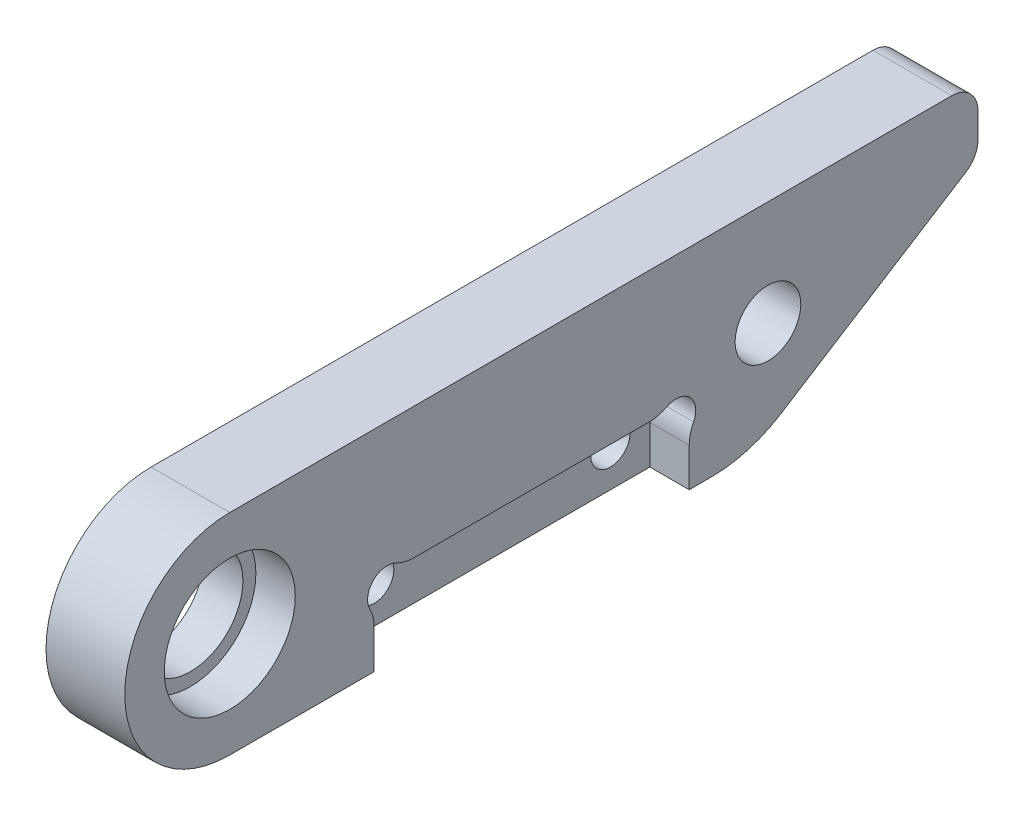
ISO-10303-21;
HEADER;
FILE_DESCRIPTION(('STEP AP214'),'2;1');
FILE_NAME('part.step','',(''),(''),'','','');
FILE_SCHEMA(('AUTOMOTIVE_DESIGN { 1 0 10303 214 1 1 1 1 }'));
ENDSEC;
DATA;
#1=APPLICATION_CONTEXT('core data for automotive mechanical design processes');
#2=APPLICATION_PROTOCOL_DEFINITION('international standard','automotive_design',2000,#1);
#3=PRODUCT_CONTEXT('',#1,'mechanical');
#4=PRODUCT('Part','Part','',(#3));
#5=PRODUCT_RELATED_PRODUCT_CATEGORY('part','',(#4));
#6=PRODUCT_DEFINITION_FORMATION('','',#4);
#7=PRODUCT_DEFINITION_CONTEXT('part definition',#1,'design');
#8=PRODUCT_DEFINITION('design','',#6,#7);
#9=PRODUCT_DEFINITION_SHAPE('','',#8);
#10=(LENGTH_UNIT() NAMED_UNIT(*) SI_UNIT(.MILLI.,.METRE.));
#11=(NAMED_UNIT(*) PLANE_ANGLE_UNIT() SI_UNIT($,.RADIAN.));
#12=(NAMED_UNIT(*) SI_UNIT($,.STERADIAN.) SOLID_ANGLE_UNIT());
#13=UNCERTAINTY_MEASURE_WITH_UNIT(LENGTH_MEASURE(1.E-05),#10,'distance_accuracy_value','');
#14=(GEOMETRIC_REPRESENTATION_CONTEXT(3) GLOBAL_UNCERTAINTY_ASSIGNED_CONTEXT((#13)) GLOBAL_UNIT_ASSIGNED_CONTEXT((#10,
#11,#12)) REPRESENTATION_CONTEXT('',''));
#15=CARTESIAN_POINT('',(0.,0.,0.));
#16=DIRECTION('',(0.,0.,1.));
#17=DIRECTION('',(1.,0.,0.));
#18=AXIS2_PLACEMENT_3D('',#15,#16,#17);
#19=CARTESIAN_POINT('',(6.,42.,-9.));
#20=DIRECTION('',(-1.,0.,0.));
#21=DIRECTION('',(0.,0.,1.));
#22=AXIS2_PLACEMENT_3D('',#19,#20,#21);
#23=CYLINDRICAL_SURFACE('',#22,4.);
#24=CARTESIAN_POINT('',(0.,42.,-9.));
#25=DIRECTION('',(1.,0.,0.));
#26=DIRECTION('',(0.,0.,-1.));
#27=AXIS2_PLACEMENT_3D('',#24,#25,#26);
#28=CIRCLE('',#27,4.);
#29=CARTESIAN_POINT('',(0.,42.,-13.));
#30=VERTEX_POINT('',#29);
#31=EDGE_CURVE('E198',#30,#30,#28,.T.);
#32=ORIENTED_EDGE('',*,*,#31,.F.);
#33=EDGE_LOOP('',(#32));
#34=FACE_BOUND('',#33,.T.);
#35=CARTESIAN_POINT('',(3.,42.,-9.));
#36=DIRECTION('',(1.,0.,0.));
#37=DIRECTION('',(0.,0.,-1.));
#38=AXIS2_PLACEMENT_3D('',#35,#36,#37);
#39=CIRCLE('',#38,4.);
#40=CARTESIAN_POINT('',(3.,42.,-13.));
#41=VERTEX_POINT('',#40);
#42=EDGE_CURVE('E193',#41,#41,#39,.T.);
#43=ORIENTED_EDGE('',*,*,#42,.T.);
#44=EDGE_LOOP('',(#43));
#45=FACE_BOUND('',#44,.T.);
#46=ADVANCED_FACE('F35',(#34,#45),#23,.F.);
#47=CARTESIAN_POINT('',(6.,42.,-9.));
#48=DIRECTION('',(1.,0.,0.));
#49=DIRECTION('',(0.,0.,-1.));
#50=AXIS2_PLACEMENT_3D('',#47,#48,#49);
#51=PLANE('',#50);
#52=DIRECTION('',(0.,0.,-1.));
#53=VECTOR('',#52,1.);
#54=CARTESIAN_POINT('',(6.,34.,-9.));
#55=LINE('',#54,#53);
#56=CARTESIAN_POINT('',(6.,34.,-44.));
#57=VERTEX_POINT('',#56);
#58=CARTESIAN_POINT('',(6.,34.,-45.6735519559303));
#59=VERTEX_POINT('',#58);
#60=EDGE_CURVE('E180',#57,#59,#55,.T.);
#61=ORIENTED_EDGE('',*,*,#60,.T.);
#62=CARTESIAN_POINT('',(6.,44.,-45.6735519559303));
#63=DIRECTION('',(1.,0.,0.));
#64=DIRECTION('',(0.,0.,-1.));
#65=AXIS2_PLACEMENT_3D('',#62,#63,#64);
#66=CIRCLE('',#65,10.);
#67=CARTESIAN_POINT('',(6.,35.5424930110662,-51.0093345163554));
#68=VERTEX_POINT('',#67);
#69=EDGE_CURVE('E11',#59,#68,#66,.T.);
#70=ORIENTED_EDGE('',*,*,#69,.T.);
#71=DIRECTION('',(0.,0.533578256042508,-0.845750698893377));
#72=VECTOR('',#71,1.);
#73=CARTESIAN_POINT('',(6.,34.,-48.5643987878584));
#74=LINE('',#73,#72);
#75=CARTESIAN_POINT('',(6.,44.411475506797,-65.067156512085));
#76=VERTEX_POINT('',#75);
#77=EDGE_CURVE('E212',#68,#76,#74,.T.);
#78=ORIENTED_EDGE('',*,*,#77,.T.);
#79=CARTESIAN_POINT('',(6.,46.1029769045838,-64.));
#80=DIRECTION('',(1.,0.,0.));
#81=DIRECTION('',(0.,0.,-1.));
#82=AXIS2_PLACEMENT_3D('',#79,#80,#81);
#83=CIRCLE('',#82,2.);
#84=CARTESIAN_POINT('',(6.,46.1029769045838,-66.));
#85=VERTEX_POINT('',#84);
#86=EDGE_CURVE('E286',#76,#85,#83,.T.);
#87=ORIENTED_EDGE('',*,*,#86,.T.);
#88=DIRECTION('',(0.,1.,0.));
#89=VECTOR('',#88,1.);
#90=CARTESIAN_POINT('',(6.,50.,-66.));
#91=LINE('',#90,#89);
#92=CARTESIAN_POINT('',(6.,48.,-66.));
#93=VERTEX_POINT('',#92);
#94=EDGE_CURVE('E214',#85,#93,#91,.T.);
#95=ORIENTED_EDGE('',*,*,#94,.T.);
#96=CARTESIAN_POINT('',(6.,48.,-64.));
#97=DIRECTION('',(1.,0.,0.));
#98=DIRECTION('',(0.,0.,-1.));
#99=AXIS2_PLACEMENT_3D('',#96,#97,#98);
#100=CIRCLE('',#99,2.);
#101=CARTESIAN_POINT('',(6.,50.,-64.));
#102=VERTEX_POINT('',#101);
#103=EDGE_CURVE('E284',#93,#102,#100,.T.);
#104=ORIENTED_EDGE('',*,*,#103,.T.);
#105=DIRECTION('',(0.,0.,1.));
#106=VECTOR('',#105,1.);
#107=CARTESIAN_POINT('',(6.,50.,-9.));
#108=LINE('',#107,#106);
#109=CARTESIAN_POINT('',(6.,50.,-9.));
#110=VERTEX_POINT('',#109);
#111=EDGE_CURVE('E217',#102,#110,#108,.T.);
#112=ORIENTED_EDGE('',*,*,#111,.T.);
#113=CARTESIAN_POINT('',(6.,42.,-9.));
#114=DIRECTION('',(1.,0.,0.));
#115=DIRECTION('',(0.,0.,-1.));
#116=AXIS2_PLACEMENT_3D('',#113,#114,#115);
#117=CIRCLE('',#116,8.);
#118=CARTESIAN_POINT('',(6.,34.,-9.));
#119=VERTEX_POINT('',#118);
#120=EDGE_CURVE('E205',#110,#119,#117,.T.);
#121=ORIENTED_EDGE('',*,*,#120,.T.);
#122=CARTESIAN_POINT('',(6.,34.,-20.));
#123=VERTEX_POINT('',#122);
#124=EDGE_CURVE('E209',#119,#123,#55,.T.);
#125=ORIENTED_EDGE('',*,*,#124,.T.);
#126=DIRECTION('',(0.,-1.,0.));
#127=VECTOR('',#126,1.);
#128=CARTESIAN_POINT('',(6.,34.,-20.));
#129=LINE('',#128,#127);
#130=CARTESIAN_POINT('',(6.,36.9384471871912,-20.));
#131=VERTEX_POINT('',#130);
#132=EDGE_CURVE('E330',#131,#123,#129,.T.);
#133=ORIENTED_EDGE('',*,*,#132,.F.);
#134=CARTESIAN_POINT('',(6.,36.9384471871912,-17.));
#135=DIRECTION('',(1.,0.,0.));
#136=DIRECTION('',(0.,0.,-1.));
#137=AXIS2_PLACEMENT_3D('',#134,#135,#136);
#138=CIRCLE('',#137,3.);
#139=CARTESIAN_POINT('',(6.,38.3128157290637,-19.6666666666667));
#140=VERTEX_POINT('',#139);
#141=EDGE_CURVE('E244',#131,#140,#138,.T.);
#142=ORIENTED_EDGE('',*,*,#141,.T.);
#143=CARTESIAN_POINT('',(6.,39.,-21.));
#144=DIRECTION('',(1.,0.,0.));
#145=DIRECTION('',(0.,0.,-1.));
#146=AXIS2_PLACEMENT_3D('',#143,#144,#145);
#147=CIRCLE('',#146,1.5);
#148=CARTESIAN_POINT('',(6.,40.3333333333333,-21.6871842709363));
#149=VERTEX_POINT('',#148);
#150=EDGE_CURVE('E338',#149,#140,#147,.T.);
#151=ORIENTED_EDGE('',*,*,#150,.F.);
#152=CARTESIAN_POINT('',(6.,43.,-23.0615528128088));
#153=DIRECTION('',(1.,0.,0.));
#154=DIRECTION('',(0.,0.,-1.));
#155=AXIS2_PLACEMENT_3D('',#152,#153,#154);
#156=CIRCLE('',#155,3.);
#157=CARTESIAN_POINT('',(6.,40.,-23.0615528128088));
#158=VERTEX_POINT('',#157);
#159=EDGE_CURVE('E242',#149,#158,#156,.T.);
#160=ORIENTED_EDGE('',*,*,#159,.T.);
#161=DIRECTION('',(0.,0.,1.));
#162=VECTOR('',#161,1.);
#163=CARTESIAN_POINT('',(6.,40.,-20.));
#164=LINE('',#163,#162);
#165=CARTESIAN_POINT('',(6.,40.,-40.9384471871912));
#166=VERTEX_POINT('',#165);
#167=EDGE_CURVE('E189',#166,#158,#164,.T.);
#168=ORIENTED_EDGE('',*,*,#167,.F.);
#169=CARTESIAN_POINT('',(6.,43.,-40.9384471871912));
#170=DIRECTION('',(1.,0.,0.));
#171=DIRECTION('',(0.,0.,-1.));
#172=AXIS2_PLACEMENT_3D('',#169,#170,#171);
#173=CIRCLE('',#172,3.);
#174=CARTESIAN_POINT('',(6.,40.3333333333333,-42.3128157290637));
#175=VERTEX_POINT('',#174);
#176=EDGE_CURVE('E246',#166,#175,#173,.T.);
#177=ORIENTED_EDGE('',*,*,#176,.T.);
#178=CARTESIAN_POINT('',(6.,39.,-43.));
#179=DIRECTION('',(1.,0.,0.));
#180=DIRECTION('',(0.,0.,-1.));
#181=AXIS2_PLACEMENT_3D('',#178,#179,#180);
#182=CIRCLE('',#181,1.5);
#183=CARTESIAN_POINT('',(6.,38.3128157290637,-44.3333333333333));
#184=VERTEX_POINT('',#183);
#185=EDGE_CURVE('E349',#184,#175,#182,.T.);
#186=ORIENTED_EDGE('',*,*,#185,.F.);
#187=CARTESIAN_POINT('',(6.,36.9384471871912,-47.));
#188=DIRECTION('',(1.,0.,0.));
#189=DIRECTION('',(0.,0.,-1.));
#190=AXIS2_PLACEMENT_3D('',#187,#188,#189);
#191=CIRCLE('',#190,3.);
#192=CARTESIAN_POINT('',(6.,36.9384471871912,-44.));
#193=VERTEX_POINT('',#192);
#194=EDGE_CURVE('E248',#184,#193,#191,.T.);
#195=ORIENTED_EDGE('',*,*,#194,.T.);
#196=DIRECTION('',(0.,1.,0.));
#197=VECTOR('',#196,1.);
#198=CARTESIAN_POINT('',(6.,34.,-44.));
#199=LINE('',#198,#197);
#200=EDGE_CURVE('E334',#57,#193,#199,.T.);
#201=ORIENTED_EDGE('',*,*,#200,.F.);
#202=EDGE_LOOP('',(#61,#70,#78,#87,#95,#104,#112,#121,#125,#133,#142,#151,#160,#168,#177,#186,
#195,#201));
#203=FACE_BOUND('',#202,.T.);
#204=CARTESIAN_POINT('',(6.,42.,-9.));
#205=DIRECTION('',(1.,0.,0.));
#206=DIRECTION('',(0.,0.,-1.));
#207=AXIS2_PLACEMENT_3D('',#204,#205,#206);
#208=CIRCLE('',#207,4.99);
#209=CARTESIAN_POINT('',(6.,42.,-13.99));
#210=VERTEX_POINT('',#209);
#211=EDGE_CURVE('E181',#210,#210,#208,.T.);
#212=ORIENTED_EDGE('',*,*,#211,.F.);
#213=EDGE_LOOP('',(#212));
#214=FACE_BOUND('',#213,.T.);
#215=CARTESIAN_POINT('',(6.,42.,-50.));
#216=DIRECTION('',(1.,0.,0.));
#217=DIRECTION('',(0.,0.,-1.));
#218=AXIS2_PLACEMENT_3D('',#215,#216,#217);
#219=CIRCLE('',#218,2.5);
#220=CARTESIAN_POINT('',(6.,42.,-52.5));
#221=VERTEX_POINT('',#220);
#222=EDGE_CURVE('E195',#221,#221,#219,.T.);
#223=ORIENTED_EDGE('',*,*,#222,.F.);
#224=EDGE_LOOP('',(#223));
#225=FACE_BOUND('',#224,.T.);
#226=ADVANCED_FACE('F310',(#203,#214,#225),#51,.T.);
#227=CARTESIAN_POINT('',(0.,42.,-9.));
#228=DIRECTION('',(1.,0.,0.));
#229=DIRECTION('',(0.,0.,-1.));
#230=AXIS2_PLACEMENT_3D('',#227,#228,#229);
#231=PLANE('',#230);
#232=CARTESIAN_POINT('',(0.,37.,-41.));
#233=DIRECTION('',(1.,0.,0.));
#234=DIRECTION('',(0.,0.,-1.));
#235=AXIS2_PLACEMENT_3D('',#232,#233,#234);
#236=CIRCLE('',#235,1.5);
#237=CARTESIAN_POINT('',(0.,37.,-42.5));
#238=VERTEX_POINT('',#237);
#239=EDGE_CURVE('E358',#238,#238,#236,.F.);
#240=ORIENTED_EDGE('',*,*,#239,.F.);
#241=EDGE_LOOP('',(#240));
#242=FACE_BOUND('',#241,.T.);
#243=CARTESIAN_POINT('',(0.,37.,-23.));
#244=DIRECTION('',(1.,0.,0.));
#245=DIRECTION('',(0.,0.,-1.));
#246=AXIS2_PLACEMENT_3D('',#243,#244,#245);
#247=CIRCLE('',#246,1.5);
#248=CARTESIAN_POINT('',(0.,37.,-24.5));
#249=VERTEX_POINT('',#248);
#250=EDGE_CURVE('E352',#249,#249,#247,.F.);
#251=ORIENTED_EDGE('',*,*,#250,.F.);
#252=EDGE_LOOP('',(#251));
#253=FACE_BOUND('',#252,.T.);
#254=ORIENTED_EDGE('',*,*,#31,.T.);
#255=EDGE_LOOP('',(#254));
#256=FACE_BOUND('',#255,.T.);
#257=DIRECTION('',(0.,0.533578256042508,-0.845750698893377));
#258=VECTOR('',#257,1.);
#259=CARTESIAN_POINT('',(0.,34.,-48.5643987878584));
#260=LINE('',#259,#258);
#261=CARTESIAN_POINT('',(0.,35.5424930110662,-51.0093345163554));
#262=VERTEX_POINT('',#261);
#263=CARTESIAN_POINT('',(0.,44.411475506797,-65.067156512085));
#264=VERTEX_POINT('',#263);
#265=EDGE_CURVE('E224',#262,#264,#260,.T.);
#266=ORIENTED_EDGE('',*,*,#265,.F.);
#267=CARTESIAN_POINT('',(0.,44.,-45.6735519559303));
#268=DIRECTION('',(1.,0.,0.));
#269=DIRECTION('',(0.,0.,-1.));
#270=AXIS2_PLACEMENT_3D('',#267,#268,#269);
#271=CIRCLE('',#270,10.);
#272=CARTESIAN_POINT('',(0.,34.,-45.6735519559303));
#273=VERTEX_POINT('',#272);
#274=EDGE_CURVE('E57',#262,#273,#271,.F.);
#275=ORIENTED_EDGE('',*,*,#274,.T.);
#276=DIRECTION('',(0.,0.,-1.));
#277=VECTOR('',#276,1.);
#278=CARTESIAN_POINT('',(0.,34.,-9.));
#279=LINE('',#278,#277);
#280=CARTESIAN_POINT('',(0.,34.,-9.));
#281=VERTEX_POINT('',#280);
#282=EDGE_CURVE('E222',#281,#273,#279,.T.);
#283=ORIENTED_EDGE('',*,*,#282,.F.);
#284=CARTESIAN_POINT('',(0.,42.,-9.));
#285=DIRECTION('',(1.,0.,0.));
#286=DIRECTION('',(0.,0.,-1.));
#287=AXIS2_PLACEMENT_3D('',#284,#285,#286);
#288=CIRCLE('',#287,8.);
#289=CARTESIAN_POINT('',(0.,50.,-9.));
#290=VERTEX_POINT('',#289);
#291=EDGE_CURVE('E204',#290,#281,#288,.T.);
#292=ORIENTED_EDGE('',*,*,#291,.F.);
#293=DIRECTION('',(0.,0.,1.));
#294=VECTOR('',#293,1.);
#295=CARTESIAN_POINT('',(0.,50.,-9.));
#296=LINE('',#295,#294);
#297=CARTESIAN_POINT('',(0.,50.,-64.));
#298=VERTEX_POINT('',#297);
#299=EDGE_CURVE('E208',#298,#290,#296,.T.);
#300=ORIENTED_EDGE('',*,*,#299,.F.);
#301=CARTESIAN_POINT('',(0.,48.,-64.));
#302=DIRECTION('',(1.,0.,0.));
#303=DIRECTION('',(0.,0.,-1.));
#304=AXIS2_PLACEMENT_3D('',#301,#302,#303);
#305=CIRCLE('',#304,2.);
#306=CARTESIAN_POINT('',(0.,48.,-66.));
#307=VERTEX_POINT('',#306);
#308=EDGE_CURVE('E276',#298,#307,#305,.F.);
#309=ORIENTED_EDGE('',*,*,#308,.T.);
#310=DIRECTION('',(0.,1.,0.));
#311=VECTOR('',#310,1.);
#312=CARTESIAN_POINT('',(0.,50.,-66.));
#313=LINE('',#312,#311);
#314=CARTESIAN_POINT('',(0.,46.1029769045838,-66.));
#315=VERTEX_POINT('',#314);
#316=EDGE_CURVE('E226',#315,#307,#313,.T.);
#317=ORIENTED_EDGE('',*,*,#316,.F.);
#318=CARTESIAN_POINT('',(0.,46.1029769045838,-64.));
#319=DIRECTION('',(1.,0.,0.));
#320=DIRECTION('',(0.,0.,-1.));
#321=AXIS2_PLACEMENT_3D('',#318,#319,#320);
#322=CIRCLE('',#321,2.);
#323=EDGE_CURVE('E278',#315,#264,#322,.F.);
#324=ORIENTED_EDGE('',*,*,#323,.T.);
#325=EDGE_LOOP('',(#266,#275,#283,#292,#300,#309,#317,#324));
#326=FACE_BOUND('',#325,.T.);
#327=CARTESIAN_POINT('',(0.,42.,-50.));
#328=DIRECTION('',(1.,0.,0.));
#329=DIRECTION('',(0.,0.,-1.));
#330=AXIS2_PLACEMENT_3D('',#327,#328,#329);
#331=CIRCLE('',#330,2.5);
#332=CARTESIAN_POINT('',(0.,42.,-52.5));
#333=VERTEX_POINT('',#332);
#334=EDGE_CURVE('E199',#333,#333,#331,.T.);
#335=ORIENTED_EDGE('',*,*,#334,.T.);
#336=EDGE_LOOP('',(#335));
#337=FACE_BOUND('',#336,.T.);
#338=ADVANCED_FACE('F300',(#242,#253,#256,#326,#337),#231,.F.);
#339=CARTESIAN_POINT('',(6.,42.,-9.));
#340=DIRECTION('',(-1.,0.,0.));
#341=DIRECTION('',(0.,0.,1.));
#342=AXIS2_PLACEMENT_3D('',#339,#340,#341);
#343=CYLINDRICAL_SURFACE('',#342,8.);
#344=ORIENTED_EDGE('',*,*,#291,.T.);
#345=DIRECTION('',(-1.,0.,0.));
#346=VECTOR('',#345,1.);
#347=CARTESIAN_POINT('',(6.,34.,-9.));
#348=LINE('',#347,#346);
#349=EDGE_CURVE('E232',#119,#281,#348,.T.);
#350=ORIENTED_EDGE('',*,*,#349,.F.);
#351=ORIENTED_EDGE('',*,*,#120,.F.);
#352=DIRECTION('',(-1.,0.,0.));
#353=VECTOR('',#352,1.);
#354=CARTESIAN_POINT('',(6.,50.,-9.));
#355=LINE('',#354,#353);
#356=EDGE_CURVE('E219',#110,#290,#355,.T.);
#357=ORIENTED_EDGE('',*,*,#356,.T.);
#358=EDGE_LOOP('',(#344,#350,#351,#357));
#359=FACE_BOUND('',#358,.T.);
#360=ADVANCED_FACE('F328',(#359),#343,.T.);
#361=CARTESIAN_POINT('',(6.,34.,-9.));
#362=DIRECTION('',(0.,1.,0.));
#363=DIRECTION('',(0.,0.,1.));
#364=AXIS2_PLACEMENT_3D('',#361,#362,#363);
#365=PLANE('',#364);
#366=ORIENTED_EDGE('',*,*,#282,.T.);
#367=DIRECTION('',(-1.,0.,0.));
#368=VECTOR('',#367,1.);
#369=CARTESIAN_POINT('',(6.,34.,-45.6735519559303));
#370=LINE('',#369,#368);
#371=EDGE_CURVE('E43',#273,#59,#370,.F.);
#372=ORIENTED_EDGE('',*,*,#371,.T.);
#373=ORIENTED_EDGE('',*,*,#60,.F.);
#374=DIRECTION('',(1.,0.,0.));
#375=VECTOR('',#374,1.);
#376=CARTESIAN_POINT('',(3.,34.,-44.));
#377=LINE('',#376,#375);
#378=CARTESIAN_POINT('',(3.,34.,-44.));
#379=VERTEX_POINT('',#378);
#380=EDGE_CURVE('E164',#379,#57,#377,.T.);
#381=ORIENTED_EDGE('',*,*,#380,.F.);
#382=DIRECTION('',(0.,0.,-1.));
#383=VECTOR('',#382,1.);
#384=CARTESIAN_POINT('',(3.,34.,-20.));
#385=LINE('',#384,#383);
#386=CARTESIAN_POINT('',(3.,34.,-20.));
#387=VERTEX_POINT('',#386);
#388=EDGE_CURVE('E170',#387,#379,#385,.T.);
#389=ORIENTED_EDGE('',*,*,#388,.F.);
#390=DIRECTION('',(1.,0.,0.));
#391=VECTOR('',#390,1.);
#392=CARTESIAN_POINT('',(3.,34.,-20.));
#393=LINE('',#392,#391);
#394=EDGE_CURVE('E182',#387,#123,#393,.T.);
#395=ORIENTED_EDGE('',*,*,#394,.T.);
#396=ORIENTED_EDGE('',*,*,#124,.F.);
#397=ORIENTED_EDGE('',*,*,#349,.T.);
#398=EDGE_LOOP('',(#366,#372,#373,#381,#389,#395,#396,#397));
#399=FACE_BOUND('',#398,.T.);
#400=ADVANCED_FACE('F179',(#399),#365,.F.);
#401=CARTESIAN_POINT('',(6.,34.,-48.5643987878584));
#402=DIRECTION('',(0.,0.845750698893377,0.533578256042508));
#403=DIRECTION('',(0.,-0.533578256042508,0.845750698893377));
#404=AXIS2_PLACEMENT_3D('',#401,#402,#403);
#405=PLANE('',#404);
#406=ORIENTED_EDGE('',*,*,#77,.F.);
#407=DIRECTION('',(-1.,0.,0.));
#408=VECTOR('',#407,1.);
#409=CARTESIAN_POINT('',(6.,35.5424930110662,-51.0093345163554));
#410=LINE('',#409,#408);
#411=EDGE_CURVE('E291',#68,#262,#410,.T.);
#412=ORIENTED_EDGE('',*,*,#411,.T.);
#413=ORIENTED_EDGE('',*,*,#265,.T.);
#414=DIRECTION('',(-1.,0.,0.));
#415=VECTOR('',#414,1.);
#416=CARTESIAN_POINT('',(6.,44.411475506797,-65.067156512085));
#417=LINE('',#416,#415);
#418=EDGE_CURVE('E281',#264,#76,#417,.F.);
#419=ORIENTED_EDGE('',*,*,#418,.T.);
#420=EDGE_LOOP('',(#406,#412,#413,#419));
#421=FACE_BOUND('',#420,.T.);
#422=ADVANCED_FACE('F297',(#421),#405,.F.);
#423=CARTESIAN_POINT('',(6.,50.,-66.));
#424=DIRECTION('',(0.,0.,1.));
#425=DIRECTION('',(0.,-1.,0.));
#426=AXIS2_PLACEMENT_3D('',#423,#424,#425);
#427=PLANE('',#426);
#428=ORIENTED_EDGE('',*,*,#94,.F.);
#429=DIRECTION('',(-1.,0.,0.));
#430=VECTOR('',#429,1.);
#431=CARTESIAN_POINT('',(6.,46.1029769045838,-66.));
#432=LINE('',#431,#430);
#433=EDGE_CURVE('E273',#85,#315,#432,.T.);
#434=ORIENTED_EDGE('',*,*,#433,.T.);
#435=ORIENTED_EDGE('',*,*,#316,.T.);
#436=DIRECTION('',(-1.,0.,0.));
#437=VECTOR('',#436,1.);
#438=CARTESIAN_POINT('',(6.,48.,-66.));
#439=LINE('',#438,#437);
#440=EDGE_CURVE('E271',#307,#93,#439,.F.);
#441=ORIENTED_EDGE('',*,*,#440,.T.);
#442=EDGE_LOOP('',(#428,#434,#435,#441));
#443=FACE_BOUND('',#442,.T.);
#444=ADVANCED_FACE('F314',(#443),#427,.F.);
#445=CARTESIAN_POINT('',(6.,50.,-9.));
#446=DIRECTION('',(0.,-1.,0.));
#447=DIRECTION('',(0.,0.,-1.));
#448=AXIS2_PLACEMENT_3D('',#445,#446,#447);
#449=PLANE('',#448);
#450=ORIENTED_EDGE('',*,*,#111,.F.);
#451=DIRECTION('',(-1.,0.,0.));
#452=VECTOR('',#451,1.);
#453=CARTESIAN_POINT('',(6.,50.,-64.));
#454=LINE('',#453,#452);
#455=EDGE_CURVE('E288',#102,#298,#454,.T.);
#456=ORIENTED_EDGE('',*,*,#455,.T.);
#457=ORIENTED_EDGE('',*,*,#299,.T.);
#458=ORIENTED_EDGE('',*,*,#356,.F.);
#459=EDGE_LOOP('',(#450,#456,#457,#458));
#460=FACE_BOUND('',#459,.T.);
#461=ADVANCED_FACE('F322',(#460),#449,.F.);
#462=CARTESIAN_POINT('',(6.,42.,-50.));
#463=DIRECTION('',(-1.,0.,0.));
#464=DIRECTION('',(0.,0.,1.));
#465=AXIS2_PLACEMENT_3D('',#462,#463,#464);
#466=CYLINDRICAL_SURFACE('',#465,2.5);
#467=ORIENTED_EDGE('',*,*,#222,.T.);
#468=EDGE_LOOP('',(#467));
#469=FACE_BOUND('',#468,.T.);
#470=ORIENTED_EDGE('',*,*,#334,.F.);
#471=EDGE_LOOP('',(#470));
#472=FACE_BOUND('',#471,.T.);
#473=ADVANCED_FACE('F401',(#469,#472),#466,.F.);
#474=CARTESIAN_POINT('',(3.,42.,-9.));
#475=DIRECTION('',(1.,0.,0.));
#476=DIRECTION('',(0.,0.,-1.));
#477=AXIS2_PLACEMENT_3D('',#474,#475,#476);
#478=CYLINDRICAL_SURFACE('',#477,4.99);
#479=CARTESIAN_POINT('',(3.,42.,-9.));
#480=DIRECTION('',(1.,0.,0.));
#481=DIRECTION('',(0.,0.,-1.));
#482=AXIS2_PLACEMENT_3D('',#479,#480,#481);
#483=CIRCLE('',#482,4.99);
#484=CARTESIAN_POINT('',(3.,42.,-13.99));
#485=VERTEX_POINT('',#484);
#486=EDGE_CURVE('E185',#485,#485,#483,.T.);
#487=ORIENTED_EDGE('',*,*,#486,.F.);
#488=EDGE_LOOP('',(#487));
#489=FACE_BOUND('',#488,.T.);
#490=ORIENTED_EDGE('',*,*,#211,.T.);
#491=EDGE_LOOP('',(#490));
#492=FACE_BOUND('',#491,.T.);
#493=ADVANCED_FACE('F395',(#489,#492),#478,.F.);
#494=CARTESIAN_POINT('',(3.,42.,-9.));
#495=DIRECTION('',(1.,0.,0.));
#496=DIRECTION('',(0.,0.,-1.));
#497=AXIS2_PLACEMENT_3D('',#494,#495,#496);
#498=PLANE('',#497);
#499=ORIENTED_EDGE('',*,*,#42,.F.);
#500=EDGE_LOOP('',(#499));
#501=FACE_BOUND('',#500,.T.);
#502=ORIENTED_EDGE('',*,*,#486,.T.);
#503=EDGE_LOOP('',(#502));
#504=FACE_BOUND('',#503,.T.);
#505=ADVANCED_FACE('F392',(#501,#504),#498,.T.);
#506=CARTESIAN_POINT('',(3.,34.,-20.));
#507=DIRECTION('',(0.,0.,1.));
#508=DIRECTION('',(1.,0.,0.));
#509=AXIS2_PLACEMENT_3D('',#506,#507,#508);
#510=PLANE('',#509);
#511=DIRECTION('',(0.,-1.,0.));
#512=VECTOR('',#511,1.);
#513=CARTESIAN_POINT('',(3.,34.,-20.));
#514=LINE('',#513,#512);
#515=CARTESIAN_POINT('',(3.,36.9384471871912,-20.));
#516=VERTEX_POINT('',#515);
#517=EDGE_CURVE('E175',#516,#387,#514,.T.);
#518=ORIENTED_EDGE('',*,*,#517,.F.);
#519=DIRECTION('',(1.,0.,0.));
#520=VECTOR('',#519,1.);
#521=CARTESIAN_POINT('',(3.,36.9384471871912,-20.));
#522=LINE('',#521,#520);
#523=EDGE_CURVE('E256',#516,#131,#522,.T.);
#524=ORIENTED_EDGE('',*,*,#523,.T.);
#525=ORIENTED_EDGE('',*,*,#132,.T.);
#526=ORIENTED_EDGE('',*,*,#394,.F.);
#527=EDGE_LOOP('',(#518,#524,#525,#526));
#528=FACE_BOUND('',#527,.T.);
#529=ADVANCED_FACE('F332',(#528),#510,.F.);
#530=CARTESIAN_POINT('',(3.,40.,-20.));
#531=DIRECTION('',(0.,1.,0.));
#532=DIRECTION('',(0.,0.,1.));
#533=AXIS2_PLACEMENT_3D('',#530,#531,#532);
#534=PLANE('',#533);
#535=DIRECTION('',(0.,0.,1.));
#536=VECTOR('',#535,1.);
#537=CARTESIAN_POINT('',(3.,40.,-20.));
#538=LINE('',#537,#536);
#539=CARTESIAN_POINT('',(3.,40.,-40.9384471871912));
#540=VERTEX_POINT('',#539);
#541=CARTESIAN_POINT('',(3.,40.,-23.0615528128088));
#542=VERTEX_POINT('',#541);
#543=EDGE_CURVE('E169',#540,#542,#538,.T.);
#544=ORIENTED_EDGE('',*,*,#543,.F.);
#545=DIRECTION('',(1.,0.,0.));
#546=VECTOR('',#545,1.);
#547=CARTESIAN_POINT('',(3.,40.,-40.9384471871912));
#548=LINE('',#547,#546);
#549=EDGE_CURVE('E253',#540,#166,#548,.T.);
#550=ORIENTED_EDGE('',*,*,#549,.T.);
#551=ORIENTED_EDGE('',*,*,#167,.T.);
#552=DIRECTION('',(1.,0.,0.));
#553=VECTOR('',#552,1.);
#554=CARTESIAN_POINT('',(3.,40.,-23.0615528128088));
#555=LINE('',#554,#553);
#556=EDGE_CURVE('E250',#158,#542,#555,.F.);
#557=ORIENTED_EDGE('',*,*,#556,.T.);
#558=EDGE_LOOP('',(#544,#550,#551,#557));
#559=FACE_BOUND('',#558,.T.);
#560=ADVANCED_FACE('F459',(#559),#534,.F.);
#561=CARTESIAN_POINT('',(3.,34.,-44.));
#562=DIRECTION('',(0.,0.,-1.));
#563=DIRECTION('',(-1.,0.,0.));
#564=AXIS2_PLACEMENT_3D('',#561,#562,#563);
#565=PLANE('',#564);
#566=ORIENTED_EDGE('',*,*,#200,.T.);
#567=DIRECTION('',(1.,0.,0.));
#568=VECTOR('',#567,1.);
#569=CARTESIAN_POINT('',(3.,36.9384471871912,-44.));
#570=LINE('',#569,#568);
#571=CARTESIAN_POINT('',(3.,36.9384471871912,-44.));
#572=VERTEX_POINT('',#571);
#573=EDGE_CURVE('E167',#193,#572,#570,.F.);
#574=ORIENTED_EDGE('',*,*,#573,.T.);
#575=DIRECTION('',(0.,1.,0.));
#576=VECTOR('',#575,1.);
#577=CARTESIAN_POINT('',(3.,34.,-44.));
#578=LINE('',#577,#576);
#579=EDGE_CURVE('E159',#379,#572,#578,.T.);
#580=ORIENTED_EDGE('',*,*,#579,.F.);
#581=ORIENTED_EDGE('',*,*,#380,.T.);
#582=EDGE_LOOP('',(#566,#574,#580,#581));
#583=FACE_BOUND('',#582,.T.);
#584=ADVANCED_FACE('F162',(#583),#565,.F.);
#585=CARTESIAN_POINT('',(3.,0.,0.));
#586=DIRECTION('',(-1.,0.,0.));
#587=DIRECTION('',(0.,0.,1.));
#588=AXIS2_PLACEMENT_3D('',#585,#586,#587);
#589=PLANE('',#588);
#590=CARTESIAN_POINT('',(3.,37.,-41.));
#591=DIRECTION('',(1.,0.,0.));
#592=DIRECTION('',(0.,0.,-1.));
#593=AXIS2_PLACEMENT_3D('',#590,#591,#592);
#594=CIRCLE('',#593,1.5);
#595=CARTESIAN_POINT('',(3.,37.,-42.5));
#596=VERTEX_POINT('',#595);
#597=EDGE_CURVE('E361',#596,#596,#594,.T.);
#598=ORIENTED_EDGE('',*,*,#597,.F.);
#599=EDGE_LOOP('',(#598));
#600=FACE_BOUND('',#599,.T.);
#601=CARTESIAN_POINT('',(3.,37.,-23.));
#602=DIRECTION('',(1.,0.,0.));
#603=DIRECTION('',(0.,0.,-1.));
#604=AXIS2_PLACEMENT_3D('',#601,#602,#603);
#605=CIRCLE('',#604,1.5);
#606=CARTESIAN_POINT('',(3.,37.,-24.5));
#607=VERTEX_POINT('',#606);
#608=EDGE_CURVE('E355',#607,#607,#605,.T.);
#609=ORIENTED_EDGE('',*,*,#608,.F.);
#610=EDGE_LOOP('',(#609));
#611=FACE_BOUND('',#610,.T.);
#612=ORIENTED_EDGE('',*,*,#579,.T.);
#613=CARTESIAN_POINT('',(3.,36.9384471871912,-47.));
#614=DIRECTION('',(-1.,0.,0.));
#615=DIRECTION('',(0.,0.,1.));
#616=AXIS2_PLACEMENT_3D('',#613,#614,#615);
#617=CIRCLE('',#616,3.);
#618=CARTESIAN_POINT('',(3.,38.3128157290637,-44.3333333333333));
#619=VERTEX_POINT('',#618);
#620=EDGE_CURVE('E263',#572,#619,#617,.T.);
#621=ORIENTED_EDGE('',*,*,#620,.T.);
#622=CARTESIAN_POINT('',(3.,39.,-43.));
#623=DIRECTION('',(-1.,0.,0.));
#624=DIRECTION('',(0.,0.,1.));
#625=AXIS2_PLACEMENT_3D('',#622,#623,#624);
#626=CIRCLE('',#625,1.5);
#627=CARTESIAN_POINT('',(3.,40.3333333333333,-42.3128157290637));
#628=VERTEX_POINT('',#627);
#629=EDGE_CURVE('E346',#619,#628,#626,.F.);
#630=ORIENTED_EDGE('',*,*,#629,.T.);
#631=CARTESIAN_POINT('',(3.,43.,-40.9384471871912));
#632=DIRECTION('',(-1.,0.,0.));
#633=DIRECTION('',(0.,0.,1.));
#634=AXIS2_PLACEMENT_3D('',#631,#632,#633);
#635=CIRCLE('',#634,3.);
#636=EDGE_CURVE('E265',#628,#540,#635,.T.);
#637=ORIENTED_EDGE('',*,*,#636,.T.);
#638=ORIENTED_EDGE('',*,*,#543,.T.);
#639=CARTESIAN_POINT('',(3.,43.,-23.0615528128088));
#640=DIRECTION('',(-1.,0.,0.));
#641=DIRECTION('',(0.,0.,1.));
#642=AXIS2_PLACEMENT_3D('',#639,#640,#641);
#643=CIRCLE('',#642,3.);
#644=CARTESIAN_POINT('',(3.,40.3333333333333,-21.6871842709363));
#645=VERTEX_POINT('',#644);
#646=EDGE_CURVE('E269',#542,#645,#643,.T.);
#647=ORIENTED_EDGE('',*,*,#646,.T.);
#648=CARTESIAN_POINT('',(3.,39.,-21.));
#649=DIRECTION('',(-1.,0.,0.));
#650=DIRECTION('',(0.,0.,1.));
#651=AXIS2_PLACEMENT_3D('',#648,#649,#650);
#652=CIRCLE('',#651,1.5);
#653=CARTESIAN_POINT('',(3.,38.3128157290637,-19.6666666666667));
#654=VERTEX_POINT('',#653);
#655=EDGE_CURVE('E335',#645,#654,#652,.F.);
#656=ORIENTED_EDGE('',*,*,#655,.T.);
#657=CARTESIAN_POINT('',(3.,36.9384471871912,-17.));
#658=DIRECTION('',(-1.,0.,0.));
#659=DIRECTION('',(0.,0.,1.));
#660=AXIS2_PLACEMENT_3D('',#657,#658,#659);
#661=CIRCLE('',#660,3.);
#662=EDGE_CURVE('E267',#654,#516,#661,.T.);
#663=ORIENTED_EDGE('',*,*,#662,.T.);
#664=ORIENTED_EDGE('',*,*,#517,.T.);
#665=ORIENTED_EDGE('',*,*,#388,.T.);
#666=EDGE_LOOP('',(#612,#621,#630,#637,#638,#647,#656,#663,#664,#665));
#667=FACE_BOUND('',#666,.T.);
#668=ADVANCED_FACE('F173',(#600,#611,#667),#589,.F.);
#669=CARTESIAN_POINT('',(-1.24264068711929,39.,-21.));
#670=DIRECTION('',(1.,0.,0.));
#671=DIRECTION('',(0.,0.,-1.));
#672=AXIS2_PLACEMENT_3D('',#669,#670,#671);
#673=CYLINDRICAL_SURFACE('',#672,1.5);
#674=ORIENTED_EDGE('',*,*,#150,.T.);
#675=DIRECTION('',(1.,0.,0.));
#676=VECTOR('',#675,1.);
#677=CARTESIAN_POINT('',(-1.24264068711929,38.3128157290637,-19.6666666666667));
#678=LINE('',#677,#676);
#679=EDGE_CURVE('E261',#140,#654,#678,.F.);
#680=ORIENTED_EDGE('',*,*,#679,.T.);
#681=ORIENTED_EDGE('',*,*,#655,.F.);
#682=DIRECTION('',(1.,0.,0.));
#683=VECTOR('',#682,1.);
#684=CARTESIAN_POINT('',(-1.24264068711929,40.3333333333333,-21.6871842709363));
#685=LINE('',#684,#683);
#686=EDGE_CURVE('E259',#645,#149,#685,.T.);
#687=ORIENTED_EDGE('',*,*,#686,.T.);
#688=EDGE_LOOP('',(#674,#680,#681,#687));
#689=FACE_BOUND('',#688,.T.);
#690=ADVANCED_FACE('F370',(#689),#673,.F.);
#691=CARTESIAN_POINT('',(-1.24264068711929,39.,-43.));
#692=DIRECTION('',(1.,0.,0.));
#693=DIRECTION('',(0.,0.,-1.));
#694=AXIS2_PLACEMENT_3D('',#691,#692,#693);
#695=CYLINDRICAL_SURFACE('',#694,1.5);
#696=ORIENTED_EDGE('',*,*,#629,.F.);
#697=DIRECTION('',(1.,0.,0.));
#698=VECTOR('',#697,1.);
#699=CARTESIAN_POINT('',(-1.24264068711929,38.3128157290637,-44.3333333333333));
#700=LINE('',#699,#698);
#701=EDGE_CURVE('E240',#619,#184,#700,.T.);
#702=ORIENTED_EDGE('',*,*,#701,.T.);
#703=ORIENTED_EDGE('',*,*,#185,.T.);
#704=DIRECTION('',(1.,0.,0.));
#705=VECTOR('',#704,1.);
#706=CARTESIAN_POINT('',(-1.24264068711929,40.3333333333333,-42.3128157290637));
#707=LINE('',#706,#705);
#708=EDGE_CURVE('E238',#175,#628,#707,.F.);
#709=ORIENTED_EDGE('',*,*,#708,.T.);
#710=EDGE_LOOP('',(#696,#702,#703,#709));
#711=FACE_BOUND('',#710,.T.);
#712=ADVANCED_FACE('F430',(#711),#695,.F.);
#713=CARTESIAN_POINT('',(-1.24264068711929,36.9384471871912,-47.));
#714=DIRECTION('',(1.,0.,0.));
#715=DIRECTION('',(0.,0.,-1.));
#716=AXIS2_PLACEMENT_3D('',#713,#714,#715);
#717=CYLINDRICAL_SURFACE('',#716,3.);
#718=ORIENTED_EDGE('',*,*,#194,.F.);
#719=ORIENTED_EDGE('',*,*,#701,.F.);
#720=ORIENTED_EDGE('',*,*,#620,.F.);
#721=ORIENTED_EDGE('',*,*,#573,.F.);
#722=EDGE_LOOP('',(#718,#719,#720,#721));
#723=FACE_BOUND('',#722,.T.);
#724=ADVANCED_FACE('F426',(#723),#717,.T.);
#725=CARTESIAN_POINT('',(-1.24264068711929,43.,-40.9384471871912));
#726=DIRECTION('',(1.,0.,0.));
#727=DIRECTION('',(0.,0.,-1.));
#728=AXIS2_PLACEMENT_3D('',#725,#726,#727);
#729=CYLINDRICAL_SURFACE('',#728,3.);
#730=ORIENTED_EDGE('',*,*,#636,.F.);
#731=ORIENTED_EDGE('',*,*,#708,.F.);
#732=ORIENTED_EDGE('',*,*,#176,.F.);
#733=ORIENTED_EDGE('',*,*,#549,.F.);
#734=EDGE_LOOP('',(#730,#731,#732,#733));
#735=FACE_BOUND('',#734,.T.);
#736=ADVANCED_FACE('F429',(#735),#729,.T.);
#737=CARTESIAN_POINT('',(-1.24264068711929,36.9384471871912,-17.));
#738=DIRECTION('',(1.,0.,0.));
#739=DIRECTION('',(0.,0.,-1.));
#740=AXIS2_PLACEMENT_3D('',#737,#738,#739);
#741=CYLINDRICAL_SURFACE('',#740,3.);
#742=ORIENTED_EDGE('',*,*,#662,.F.);
#743=ORIENTED_EDGE('',*,*,#679,.F.);
#744=ORIENTED_EDGE('',*,*,#141,.F.);
#745=ORIENTED_EDGE('',*,*,#523,.F.);
#746=EDGE_LOOP('',(#742,#743,#744,#745));
#747=FACE_BOUND('',#746,.T.);
#748=ADVANCED_FACE('F434',(#747),#741,.T.);
#749=CARTESIAN_POINT('',(-1.24264068711929,43.,-23.0615528128088));
#750=DIRECTION('',(1.,0.,0.));
#751=DIRECTION('',(0.,0.,-1.));
#752=AXIS2_PLACEMENT_3D('',#749,#750,#751);
#753=CYLINDRICAL_SURFACE('',#752,3.);
#754=ORIENTED_EDGE('',*,*,#159,.F.);
#755=ORIENTED_EDGE('',*,*,#686,.F.);
#756=ORIENTED_EDGE('',*,*,#646,.F.);
#757=ORIENTED_EDGE('',*,*,#556,.F.);
#758=EDGE_LOOP('',(#754,#755,#756,#757));
#759=FACE_BOUND('',#758,.T.);
#760=ADVANCED_FACE('F377',(#759),#753,.T.);
#761=CARTESIAN_POINT('',(-0.00100000000000013,37.,-23.));
#762=DIRECTION('',(1.,0.,0.));
#763=DIRECTION('',(0.,0.,-1.));
#764=AXIS2_PLACEMENT_3D('',#761,#762,#763);
#765=CYLINDRICAL_SURFACE('',#764,1.5);
#766=ORIENTED_EDGE('',*,*,#608,.T.);
#767=EDGE_LOOP('',(#766));
#768=FACE_BOUND('',#767,.T.);
#769=ORIENTED_EDGE('',*,*,#250,.T.);
#770=EDGE_LOOP('',(#769));
#771=FACE_BOUND('',#770,.T.);
#772=ADVANCED_FACE('F374',(#768,#771),#765,.F.);
#773=CARTESIAN_POINT('',(-0.00100000000000013,37.,-41.));
#774=DIRECTION('',(1.,0.,0.));
#775=DIRECTION('',(0.,0.,-1.));
#776=AXIS2_PLACEMENT_3D('',#773,#774,#775);
#777=CYLINDRICAL_SURFACE('',#776,1.5);
#778=ORIENTED_EDGE('',*,*,#597,.T.);
#779=EDGE_LOOP('',(#778));
#780=FACE_BOUND('',#779,.T.);
#781=ORIENTED_EDGE('',*,*,#239,.T.);
#782=EDGE_LOOP('',(#781));
#783=FACE_BOUND('',#782,.T.);
#784=ADVANCED_FACE('F365',(#780,#783),#777,.F.);
#785=CARTESIAN_POINT('',(6.,46.1029769045838,-64.));
#786=DIRECTION('',(-1.,0.,0.));
#787=DIRECTION('',(0.,0.,1.));
#788=AXIS2_PLACEMENT_3D('',#785,#786,#787);
#789=CYLINDRICAL_SURFACE('',#788,2.);
#790=ORIENTED_EDGE('',*,*,#86,.F.);
#791=ORIENTED_EDGE('',*,*,#418,.F.);
#792=ORIENTED_EDGE('',*,*,#323,.F.);
#793=ORIENTED_EDGE('',*,*,#433,.F.);
#794=EDGE_LOOP('',(#790,#791,#792,#793));
#795=FACE_BOUND('',#794,.T.);
#796=ADVANCED_FACE('F307',(#795),#789,.T.);
#797=CARTESIAN_POINT('',(6.,48.,-64.));
#798=DIRECTION('',(-1.,0.,0.));
#799=DIRECTION('',(0.,0.,1.));
#800=AXIS2_PLACEMENT_3D('',#797,#798,#799);
#801=CYLINDRICAL_SURFACE('',#800,2.);
#802=ORIENTED_EDGE('',*,*,#103,.F.);
#803=ORIENTED_EDGE('',*,*,#440,.F.);
#804=ORIENTED_EDGE('',*,*,#308,.F.);
#805=ORIENTED_EDGE('',*,*,#455,.F.);
#806=EDGE_LOOP('',(#802,#803,#804,#805));
#807=FACE_BOUND('',#806,.T.);
#808=ADVANCED_FACE('F317',(#807),#801,.T.);
#809=CARTESIAN_POINT('',(6.,44.,-45.6735519559303));
#810=DIRECTION('',(-1.,0.,0.));
#811=DIRECTION('',(0.,0.,1.));
#812=AXIS2_PLACEMENT_3D('',#809,#810,#811);
#813=CYLINDRICAL_SURFACE('',#812,10.);
#814=ORIENTED_EDGE('',*,*,#69,.F.);
#815=ORIENTED_EDGE('',*,*,#371,.F.);
#816=ORIENTED_EDGE('',*,*,#274,.F.);
#817=ORIENTED_EDGE('',*,*,#411,.F.);
#818=EDGE_LOOP('',(#814,#815,#816,#817));
#819=FACE_BOUND('',#818,.T.);
#820=ADVANCED_FACE('F37',(#819),#813,.T.);
#821=CLOSED_SHELL('',(#46,#226,#338,#360,#400,#422,#444,#461,#473,#493,#505,#529,#560,#584,#668,
#690,#712,#724,#736,#748,#760,#772,#784,#796,#808,#820));
#822=MANIFOLD_SOLID_BREP('B2',#821);
#823=ADVANCED_BREP_SHAPE_REPRESENTATION('',(#18,#822),#14);
#824=SHAPE_DEFINITION_REPRESENTATION(#9,#823);
ENDSEC;
END-ISO-10303-21;
